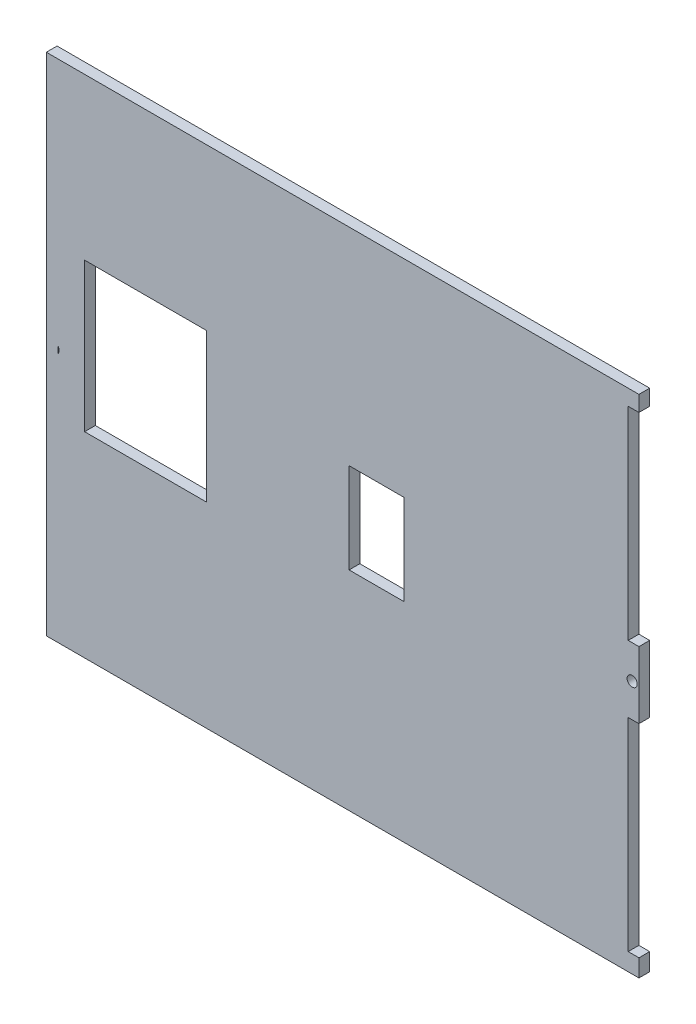
ISO-10303-21;
HEADER;
FILE_DESCRIPTION(('STEP AP214'),'2;1');
FILE_NAME('part.step','',(''),(''),'','','');
FILE_SCHEMA(('AUTOMOTIVE_DESIGN { 1 0 10303 214 1 1 1 1 }'));
ENDSEC;
DATA;
#1=APPLICATION_CONTEXT('core data for automotive mechanical design processes');
#2=APPLICATION_PROTOCOL_DEFINITION('international standard','automotive_design',2000,#1);
#3=PRODUCT_CONTEXT('',#1,'mechanical');
#4=PRODUCT('Part','Part','',(#3));
#5=PRODUCT_RELATED_PRODUCT_CATEGORY('part','',(#4));
#6=PRODUCT_DEFINITION_FORMATION('','',#4);
#7=PRODUCT_DEFINITION_CONTEXT('part definition',#1,'design');
#8=PRODUCT_DEFINITION('design','',#6,#7);
#9=PRODUCT_DEFINITION_SHAPE('','',#8);
#10=(LENGTH_UNIT() NAMED_UNIT(*) SI_UNIT(.MILLI.,.METRE.));
#11=(NAMED_UNIT(*) PLANE_ANGLE_UNIT() SI_UNIT($,.RADIAN.));
#12=(NAMED_UNIT(*) SI_UNIT($,.STERADIAN.) SOLID_ANGLE_UNIT());
#13=UNCERTAINTY_MEASURE_WITH_UNIT(LENGTH_MEASURE(1.E-05),#10,'distance_accuracy_value','');
#14=(GEOMETRIC_REPRESENTATION_CONTEXT(3) GLOBAL_UNCERTAINTY_ASSIGNED_CONTEXT((#13)) GLOBAL_UNIT_ASSIGNED_CONTEXT((#10,
#11,#12)) REPRESENTATION_CONTEXT('',''));
#15=CARTESIAN_POINT('',(0.,0.,0.));
#16=DIRECTION('',(0.,0.,1.));
#17=DIRECTION('',(1.,0.,0.));
#18=AXIS2_PLACEMENT_3D('',#15,#16,#17);
#19=CARTESIAN_POINT('',(87.5,69.85,3.18));
#20=DIRECTION('',(-1.,0.,0.));
#21=DIRECTION('',(0.,-1.,0.));
#22=AXIS2_PLACEMENT_3D('',#19,#20,#21);
#23=PLANE('',#22);
#24=DIRECTION('',(0.,1.,0.));
#25=VECTOR('',#24,1.);
#26=CARTESIAN_POINT('',(87.5,69.85,0.));
#27=LINE('',#26,#25);
#28=CARTESIAN_POINT('',(87.5,-9.875,0.));
#29=VERTEX_POINT('',#28);
#30=CARTESIAN_POINT('',(87.5,9.875,0.));
#31=VERTEX_POINT('',#30);
#32=EDGE_CURVE('E359',#29,#31,#27,.T.);
#33=ORIENTED_EDGE('',*,*,#32,.T.);
#34=DIRECTION('',(0.,0.,1.));
#35=VECTOR('',#34,1.);
#36=CARTESIAN_POINT('',(87.5,9.875,0.));
#37=LINE('',#36,#35);
#38=CARTESIAN_POINT('',(87.5,9.875,3.18));
#39=VERTEX_POINT('',#38);
#40=EDGE_CURVE('E325',#31,#39,#37,.T.);
#41=ORIENTED_EDGE('',*,*,#40,.T.);
#42=DIRECTION('',(0.,1.,0.));
#43=VECTOR('',#42,1.);
#44=CARTESIAN_POINT('',(87.5,69.85,3.18));
#45=LINE('',#44,#43);
#46=CARTESIAN_POINT('',(87.5,-9.875,3.18));
#47=VERTEX_POINT('',#46);
#48=EDGE_CURVE('E362',#47,#39,#45,.T.);
#49=ORIENTED_EDGE('',*,*,#48,.F.);
#50=DIRECTION('',(0.,0.,1.));
#51=VECTOR('',#50,1.);
#52=CARTESIAN_POINT('',(87.5,-9.875,0.));
#53=LINE('',#52,#51);
#54=EDGE_CURVE('E340',#29,#47,#53,.T.);
#55=ORIENTED_EDGE('',*,*,#54,.F.);
#56=EDGE_LOOP('',(#33,#41,#49,#55));
#57=FACE_BOUND('',#56,.T.);
#58=ADVANCED_FACE('F35',(#57),#23,.F.);
#59=CARTESIAN_POINT('',(0.,0.,3.18));
#60=DIRECTION('',(0.,0.,1.));
#61=DIRECTION('',(1.,0.,0.));
#62=AXIS2_PLACEMENT_3D('',#59,#60,#61);
#63=PLANE('',#62);
#64=DIRECTION('',(1.,0.,0.));
#65=VECTOR('',#64,1.);
#66=CARTESIAN_POINT('',(87.5,-69.85,3.18));
#67=LINE('',#66,#65);
#68=CARTESIAN_POINT('',(84.32,-69.85,3.18));
#69=VERTEX_POINT('',#68);
#70=CARTESIAN_POINT('',(87.5,-69.85,3.18));
#71=VERTEX_POINT('',#70);
#72=EDGE_CURVE('E195',#69,#71,#67,.T.);
#73=ORIENTED_EDGE('',*,*,#72,.F.);
#74=DIRECTION('',(0.,-1.,0.));
#75=VECTOR('',#74,1.);
#76=CARTESIAN_POINT('',(84.32,-69.85,3.18));
#77=LINE('',#76,#75);
#78=CARTESIAN_POINT('',(84.32,-9.875,3.18));
#79=VERTEX_POINT('',#78);
#80=EDGE_CURVE('E337',#79,#69,#77,.T.);
#81=ORIENTED_EDGE('',*,*,#80,.F.);
#82=DIRECTION('',(-1.,0.,0.));
#83=VECTOR('',#82,1.);
#84=CARTESIAN_POINT('',(87.5,-9.875,3.18));
#85=LINE('',#84,#83);
#86=EDGE_CURVE('E341',#47,#79,#85,.T.);
#87=ORIENTED_EDGE('',*,*,#86,.F.);
#88=ORIENTED_EDGE('',*,*,#48,.T.);
#89=DIRECTION('',(1.,0.,0.));
#90=VECTOR('',#89,1.);
#91=CARTESIAN_POINT('',(87.5,9.875,3.18));
#92=LINE('',#91,#90);
#93=CARTESIAN_POINT('',(84.32,9.875,3.18));
#94=VERTEX_POINT('',#93);
#95=EDGE_CURVE('E318',#94,#39,#92,.T.);
#96=ORIENTED_EDGE('',*,*,#95,.F.);
#97=DIRECTION('',(0.,-1.,0.));
#98=VECTOR('',#97,1.);
#99=CARTESIAN_POINT('',(84.32,69.85,3.18));
#100=LINE('',#99,#98);
#101=CARTESIAN_POINT('',(84.32,69.85,3.18));
#102=VERTEX_POINT('',#101);
#103=EDGE_CURVE('E307',#102,#94,#100,.T.);
#104=ORIENTED_EDGE('',*,*,#103,.F.);
#105=DIRECTION('',(-1.,0.,0.));
#106=VECTOR('',#105,1.);
#107=CARTESIAN_POINT('',(-84.32,69.85,3.18));
#108=LINE('',#107,#106);
#109=CARTESIAN_POINT('',(87.5,69.85,3.18));
#110=VERTEX_POINT('',#109);
#111=EDGE_CURVE('E221',#110,#102,#108,.T.);
#112=ORIENTED_EDGE('',*,*,#111,.F.);
#113=DIRECTION('',(0.,-1.,0.));
#114=VECTOR('',#113,1.);
#115=CARTESIAN_POINT('',(87.5,69.85,3.18));
#116=LINE('',#115,#114);
#117=CARTESIAN_POINT('',(87.5,74.493800825806,3.18));
#118=VERTEX_POINT('',#117);
#119=EDGE_CURVE('E218',#118,#110,#116,.T.);
#120=ORIENTED_EDGE('',*,*,#119,.F.);
#121=DIRECTION('',(1.,0.,0.));
#122=VECTOR('',#121,1.);
#123=CARTESIAN_POINT('',(-84.32,74.493800825806,3.18));
#124=LINE('',#123,#122);
#125=CARTESIAN_POINT('',(-87.8082205647388,74.493800825806,3.18));
#126=VERTEX_POINT('',#125);
#127=EDGE_CURVE('E216',#126,#118,#124,.T.);
#128=ORIENTED_EDGE('',*,*,#127,.F.);
#129=DIRECTION('',(0.,1.,0.));
#130=VECTOR('',#129,1.);
#131=CARTESIAN_POINT('',(-87.8082205647388,-75.0250038114615,3.18));
#132=LINE('',#131,#130);
#133=CARTESIAN_POINT('',(-87.8082205647388,-75.0250038114615,3.18));
#134=VERTEX_POINT('',#133);
#135=EDGE_CURVE('E205',#134,#126,#132,.T.);
#136=ORIENTED_EDGE('',*,*,#135,.F.);
#137=DIRECTION('',(-1.,0.,0.));
#138=VECTOR('',#137,1.);
#139=CARTESIAN_POINT('',(87.5,-75.0250038114615,3.18));
#140=LINE('',#139,#138);
#141=CARTESIAN_POINT('',(87.5,-75.0250038114615,3.18));
#142=VERTEX_POINT('',#141);
#143=EDGE_CURVE('E186',#142,#134,#140,.T.);
#144=ORIENTED_EDGE('',*,*,#143,.F.);
#145=DIRECTION('',(0.,-1.,0.));
#146=VECTOR('',#145,1.);
#147=CARTESIAN_POINT('',(87.5,-69.85,3.18));
#148=LINE('',#147,#146);
#149=EDGE_CURVE('E203',#71,#142,#148,.T.);
#150=ORIENTED_EDGE('',*,*,#149,.F.);
#151=EDGE_LOOP('',(#73,#81,#87,#88,#96,#104,#112,#120,#128,#136,#144,#150));
#152=FACE_BOUND('',#151,.T.);
#153=CARTESIAN_POINT('',(-85.5,0.,3.18));
#154=DIRECTION('',(0.,0.,1.));
#155=DIRECTION('',(1.,0.,0.));
#156=AXIS2_PLACEMENT_3D('',#153,#154,#155);
#157=CIRCLE('',#156,1.5);
#158=CARTESIAN_POINT('',(-84.32,-0.926066952223204,3.18));
#159=VERTEX_POINT('',#158);
#160=CARTESIAN_POINT('',(-84.32,0.926066952223205,3.18));
#161=VERTEX_POINT('',#160);
#162=EDGE_CURVE('E349',#159,#161,#157,.T.);
#163=ORIENTED_EDGE('',*,*,#162,.F.);
#164=DIRECTION('',(0.,-1.,0.));
#165=VECTOR('',#164,1.);
#166=CARTESIAN_POINT('',(-84.32,-69.85,3.18));
#167=LINE('',#166,#165);
#168=EDGE_CURVE('E223',#161,#159,#167,.T.);
#169=ORIENTED_EDGE('',*,*,#168,.F.);
#170=EDGE_LOOP('',(#163,#169));
#171=FACE_BOUND('',#170,.T.);
#172=DIRECTION('',(0.,1.,0.));
#173=VECTOR('',#172,1.);
#174=CARTESIAN_POINT('',(1.76180209950871,-13.3525709520135,3.18));
#175=LINE('',#174,#173);
#176=CARTESIAN_POINT('',(1.76180209950871,-13.3525709520135,3.18));
#177=VERTEX_POINT('',#176);
#178=CARTESIAN_POINT('',(1.76180209950871,13.3525709520135,3.18));
#179=VERTEX_POINT('',#178);
#180=EDGE_CURVE('E252',#177,#179,#175,.T.);
#181=ORIENTED_EDGE('',*,*,#180,.T.);
#182=DIRECTION('',(1.,0.,0.));
#183=VECTOR('',#182,1.);
#184=CARTESIAN_POINT('',(17.9358844809485,13.3525709520135,3.18));
#185=LINE('',#184,#183);
#186=CARTESIAN_POINT('',(17.9358844809485,13.3525709520135,3.18));
#187=VERTEX_POINT('',#186);
#188=EDGE_CURVE('E255',#179,#187,#185,.T.);
#189=ORIENTED_EDGE('',*,*,#188,.T.);
#190=DIRECTION('',(0.,-1.,0.));
#191=VECTOR('',#190,1.);
#192=CARTESIAN_POINT('',(17.9358844809485,-13.3525709520135,3.18));
#193=LINE('',#192,#191);
#194=CARTESIAN_POINT('',(17.9358844809485,-13.3525709520135,3.18));
#195=VERTEX_POINT('',#194);
#196=EDGE_CURVE('E56',#187,#195,#193,.T.);
#197=ORIENTED_EDGE('',*,*,#196,.T.);
#198=DIRECTION('',(-1.,0.,0.));
#199=VECTOR('',#198,1.);
#200=CARTESIAN_POINT('',(17.9358844809485,-13.3525709520135,3.18));
#201=LINE('',#200,#199);
#202=EDGE_CURVE('E260',#195,#177,#201,.T.);
#203=ORIENTED_EDGE('',*,*,#202,.T.);
#204=EDGE_LOOP('',(#181,#189,#197,#203));
#205=FACE_BOUND('',#204,.T.);
#206=DIRECTION('',(0.,1.,0.));
#207=VECTOR('',#206,1.);
#208=CARTESIAN_POINT('',(-76.4830707518911,-17.0655632801981,3.18));
#209=LINE('',#208,#207);
#210=CARTESIAN_POINT('',(-76.4830707518911,-17.0655632801981,3.18));
#211=VERTEX_POINT('',#210);
#212=CARTESIAN_POINT('',(-76.4830707518911,26.8946423522323,3.18));
#213=VERTEX_POINT('',#212);
#214=EDGE_CURVE('E282',#211,#213,#209,.T.);
#215=ORIENTED_EDGE('',*,*,#214,.T.);
#216=DIRECTION('',(1.,0.,0.));
#217=VECTOR('',#216,1.);
#218=CARTESIAN_POINT('',(-40.4709664732792,26.8946423522323,3.18));
#219=LINE('',#218,#217);
#220=CARTESIAN_POINT('',(-40.4709664732792,26.8946423522323,3.18));
#221=VERTEX_POINT('',#220);
#222=EDGE_CURVE('E285',#213,#221,#219,.T.);
#223=ORIENTED_EDGE('',*,*,#222,.T.);
#224=DIRECTION('',(0.,-1.,0.));
#225=VECTOR('',#224,1.);
#226=CARTESIAN_POINT('',(-40.4709664732792,-17.0655632801981,3.18));
#227=LINE('',#226,#225);
#228=CARTESIAN_POINT('',(-40.4709664732792,-17.0655632801981,3.18));
#229=VERTEX_POINT('',#228);
#230=EDGE_CURVE('E289',#221,#229,#227,.T.);
#231=ORIENTED_EDGE('',*,*,#230,.T.);
#232=DIRECTION('',(-1.,0.,0.));
#233=VECTOR('',#232,1.);
#234=CARTESIAN_POINT('',(-40.4709664732792,-17.0655632801981,3.18));
#235=LINE('',#234,#233);
#236=EDGE_CURVE('E292',#229,#211,#235,.T.);
#237=ORIENTED_EDGE('',*,*,#236,.T.);
#238=EDGE_LOOP('',(#215,#223,#231,#237));
#239=FACE_BOUND('',#238,.T.);
#240=CARTESIAN_POINT('',(85.5,0.,3.18));
#241=DIRECTION('',(0.,0.,1.));
#242=DIRECTION('',(-1.,0.,0.));
#243=AXIS2_PLACEMENT_3D('',#240,#241,#242);
#244=CIRCLE('',#243,1.5);
#245=CARTESIAN_POINT('',(84.,0.,3.18));
#246=VERTEX_POINT('',#245);
#247=EDGE_CURVE('E328',#246,#246,#244,.T.);
#248=ORIENTED_EDGE('',*,*,#247,.F.);
#249=EDGE_LOOP('',(#248));
#250=FACE_BOUND('',#249,.T.);
#251=ADVANCED_FACE('F201',(#152,#171,#205,#239,#250),#63,.T.);
#252=CARTESIAN_POINT('',(0.,0.,0.));
#253=DIRECTION('',(0.,0.,1.));
#254=DIRECTION('',(1.,0.,0.));
#255=AXIS2_PLACEMENT_3D('',#252,#253,#254);
#256=PLANE('',#255);
#257=DIRECTION('',(0.,-1.,0.));
#258=VECTOR('',#257,1.);
#259=CARTESIAN_POINT('',(84.32,-69.85,0.));
#260=LINE('',#259,#258);
#261=CARTESIAN_POINT('',(84.32,-9.875,0.));
#262=VERTEX_POINT('',#261);
#263=CARTESIAN_POINT('',(84.32,-69.85,0.));
#264=VERTEX_POINT('',#263);
#265=EDGE_CURVE('E336',#262,#264,#260,.T.);
#266=ORIENTED_EDGE('',*,*,#265,.T.);
#267=DIRECTION('',(1.,0.,0.));
#268=VECTOR('',#267,1.);
#269=CARTESIAN_POINT('',(87.5,-69.85,0.));
#270=LINE('',#269,#268);
#271=CARTESIAN_POINT('',(87.5,-69.85,0.));
#272=VERTEX_POINT('',#271);
#273=EDGE_CURVE('E211',#264,#272,#270,.T.);
#274=ORIENTED_EDGE('',*,*,#273,.T.);
#275=DIRECTION('',(0.,-1.,0.));
#276=VECTOR('',#275,1.);
#277=CARTESIAN_POINT('',(87.5,-69.85,0.));
#278=LINE('',#277,#276);
#279=CARTESIAN_POINT('',(87.5,-75.0250038114615,0.));
#280=VERTEX_POINT('',#279);
#281=EDGE_CURVE('E226',#272,#280,#278,.T.);
#282=ORIENTED_EDGE('',*,*,#281,.T.);
#283=DIRECTION('',(-1.,0.,0.));
#284=VECTOR('',#283,1.);
#285=CARTESIAN_POINT('',(-84.32,-75.0250038114615,0.));
#286=LINE('',#285,#284);
#287=CARTESIAN_POINT('',(-87.8082205647388,-75.0250038114615,0.));
#288=VERTEX_POINT('',#287);
#289=EDGE_CURVE('E189',#280,#288,#286,.T.);
#290=ORIENTED_EDGE('',*,*,#289,.T.);
#291=DIRECTION('',(0.,1.,0.));
#292=VECTOR('',#291,1.);
#293=CARTESIAN_POINT('',(-87.8082205647388,-69.85,0.));
#294=LINE('',#293,#292);
#295=CARTESIAN_POINT('',(-87.8082205647388,74.493800825806,0.));
#296=VERTEX_POINT('',#295);
#297=EDGE_CURVE('E229',#288,#296,#294,.T.);
#298=ORIENTED_EDGE('',*,*,#297,.T.);
#299=DIRECTION('',(1.,0.,0.));
#300=VECTOR('',#299,1.);
#301=CARTESIAN_POINT('',(-84.32,74.493800825806,0.));
#302=LINE('',#301,#300);
#303=CARTESIAN_POINT('',(87.5,74.493800825806,0.));
#304=VERTEX_POINT('',#303);
#305=EDGE_CURVE('E232',#296,#304,#302,.T.);
#306=ORIENTED_EDGE('',*,*,#305,.T.);
#307=DIRECTION('',(0.,-1.,0.));
#308=VECTOR('',#307,1.);
#309=CARTESIAN_POINT('',(87.5,69.85,0.));
#310=LINE('',#309,#308);
#311=CARTESIAN_POINT('',(87.5,69.85,0.));
#312=VERTEX_POINT('',#311);
#313=EDGE_CURVE('E235',#304,#312,#310,.T.);
#314=ORIENTED_EDGE('',*,*,#313,.T.);
#315=DIRECTION('',(-1.,0.,0.));
#316=VECTOR('',#315,1.);
#317=CARTESIAN_POINT('',(-84.32,69.85,0.));
#318=LINE('',#317,#316);
#319=CARTESIAN_POINT('',(84.32,69.85,0.));
#320=VERTEX_POINT('',#319);
#321=EDGE_CURVE('E238',#312,#320,#318,.T.);
#322=ORIENTED_EDGE('',*,*,#321,.T.);
#323=DIRECTION('',(0.,-1.,0.));
#324=VECTOR('',#323,1.);
#325=CARTESIAN_POINT('',(84.32,69.85,0.));
#326=LINE('',#325,#324);
#327=CARTESIAN_POINT('',(84.32,9.875,0.));
#328=VERTEX_POINT('',#327);
#329=EDGE_CURVE('E314',#320,#328,#326,.T.);
#330=ORIENTED_EDGE('',*,*,#329,.T.);
#331=DIRECTION('',(1.,0.,0.));
#332=VECTOR('',#331,1.);
#333=CARTESIAN_POINT('',(87.5,9.875,0.));
#334=LINE('',#333,#332);
#335=EDGE_CURVE('E317',#328,#31,#334,.T.);
#336=ORIENTED_EDGE('',*,*,#335,.T.);
#337=ORIENTED_EDGE('',*,*,#32,.F.);
#338=DIRECTION('',(-1.,0.,0.));
#339=VECTOR('',#338,1.);
#340=CARTESIAN_POINT('',(87.5,-9.875,0.));
#341=LINE('',#340,#339);
#342=EDGE_CURVE('E333',#29,#262,#341,.T.);
#343=ORIENTED_EDGE('',*,*,#342,.T.);
#344=EDGE_LOOP('',(#266,#274,#282,#290,#298,#306,#314,#322,#330,#336,#337,#343));
#345=FACE_BOUND('',#344,.T.);
#346=DIRECTION('',(0.,-1.,0.));
#347=VECTOR('',#346,1.);
#348=CARTESIAN_POINT('',(-84.32,-69.85,0.));
#349=LINE('',#348,#347);
#350=CARTESIAN_POINT('',(-84.32,0.926066952223205,0.));
#351=VERTEX_POINT('',#350);
#352=CARTESIAN_POINT('',(-84.32,-0.926066952223199,0.));
#353=VERTEX_POINT('',#352);
#354=EDGE_CURVE('E48',#351,#353,#349,.T.);
#355=ORIENTED_EDGE('',*,*,#354,.T.);
#356=CARTESIAN_POINT('',(-85.5,0.,0.));
#357=DIRECTION('',(0.,0.,1.));
#358=DIRECTION('',(1.,0.,0.));
#359=AXIS2_PLACEMENT_3D('',#356,#357,#358);
#360=CIRCLE('',#359,1.5);
#361=EDGE_CURVE('E357',#353,#351,#360,.T.);
#362=ORIENTED_EDGE('',*,*,#361,.T.);
#363=EDGE_LOOP('',(#355,#362));
#364=FACE_BOUND('',#363,.T.);
#365=DIRECTION('',(1.,0.,0.));
#366=VECTOR('',#365,1.);
#367=CARTESIAN_POINT('',(17.9358844809485,13.3525709520135,0.));
#368=LINE('',#367,#366);
#369=CARTESIAN_POINT('',(1.76180209950871,13.3525709520135,0.));
#370=VERTEX_POINT('',#369);
#371=CARTESIAN_POINT('',(17.9358844809485,13.3525709520135,0.));
#372=VERTEX_POINT('',#371);
#373=EDGE_CURVE('E265',#370,#372,#368,.T.);
#374=ORIENTED_EDGE('',*,*,#373,.F.);
#375=DIRECTION('',(0.,1.,0.));
#376=VECTOR('',#375,1.);
#377=CARTESIAN_POINT('',(1.76180209950871,-13.3525709520135,0.));
#378=LINE('',#377,#376);
#379=CARTESIAN_POINT('',(1.76180209950871,-13.3525709520135,0.));
#380=VERTEX_POINT('',#379);
#381=EDGE_CURVE('E243',#380,#370,#378,.T.);
#382=ORIENTED_EDGE('',*,*,#381,.F.);
#383=DIRECTION('',(-1.,0.,0.));
#384=VECTOR('',#383,1.);
#385=CARTESIAN_POINT('',(17.9358844809485,-13.3525709520135,0.));
#386=LINE('',#385,#384);
#387=CARTESIAN_POINT('',(17.9358844809485,-13.3525709520135,0.));
#388=VERTEX_POINT('',#387);
#389=EDGE_CURVE('E256',#388,#380,#386,.T.);
#390=ORIENTED_EDGE('',*,*,#389,.F.);
#391=DIRECTION('',(0.,-1.,0.));
#392=VECTOR('',#391,1.);
#393=CARTESIAN_POINT('',(17.9358844809485,-13.3525709520135,0.));
#394=LINE('',#393,#392);
#395=EDGE_CURVE('E268',#372,#388,#394,.T.);
#396=ORIENTED_EDGE('',*,*,#395,.F.);
#397=EDGE_LOOP('',(#374,#382,#390,#396));
#398=FACE_BOUND('',#397,.T.);
#399=DIRECTION('',(1.,0.,0.));
#400=VECTOR('',#399,1.);
#401=CARTESIAN_POINT('',(-40.4709664732792,26.8946423522323,0.));
#402=LINE('',#401,#400);
#403=CARTESIAN_POINT('',(-76.4830707518911,26.8946423522323,0.));
#404=VERTEX_POINT('',#403);
#405=CARTESIAN_POINT('',(-40.4709664732792,26.8946423522323,0.));
#406=VERTEX_POINT('',#405);
#407=EDGE_CURVE('E297',#404,#406,#402,.T.);
#408=ORIENTED_EDGE('',*,*,#407,.F.);
#409=DIRECTION('',(0.,1.,0.));
#410=VECTOR('',#409,1.);
#411=CARTESIAN_POINT('',(-76.4830707518911,-17.0655632801981,0.));
#412=LINE('',#411,#410);
#413=CARTESIAN_POINT('',(-76.4830707518911,-17.0655632801981,0.));
#414=VERTEX_POINT('',#413);
#415=EDGE_CURVE('E275',#414,#404,#412,.T.);
#416=ORIENTED_EDGE('',*,*,#415,.F.);
#417=DIRECTION('',(-1.,0.,0.));
#418=VECTOR('',#417,1.);
#419=CARTESIAN_POINT('',(-40.4709664732792,-17.0655632801981,0.));
#420=LINE('',#419,#418);
#421=CARTESIAN_POINT('',(-40.4709664732792,-17.0655632801981,0.));
#422=VERTEX_POINT('',#421);
#423=EDGE_CURVE('E286',#422,#414,#420,.T.);
#424=ORIENTED_EDGE('',*,*,#423,.F.);
#425=DIRECTION('',(0.,-1.,0.));
#426=VECTOR('',#425,1.);
#427=CARTESIAN_POINT('',(-40.4709664732792,-17.0655632801981,0.));
#428=LINE('',#427,#426);
#429=EDGE_CURVE('E300',#406,#422,#428,.T.);
#430=ORIENTED_EDGE('',*,*,#429,.F.);
#431=EDGE_LOOP('',(#408,#416,#424,#430));
#432=FACE_BOUND('',#431,.T.);
#433=CARTESIAN_POINT('',(85.5,0.,0.));
#434=DIRECTION('',(0.,0.,1.));
#435=DIRECTION('',(-1.,0.,0.));
#436=AXIS2_PLACEMENT_3D('',#433,#434,#435);
#437=CIRCLE('',#436,1.5);
#438=CARTESIAN_POINT('',(84.,0.,0.));
#439=VERTEX_POINT('',#438);
#440=EDGE_CURVE('E344',#439,#439,#437,.T.);
#441=ORIENTED_EDGE('',*,*,#440,.T.);
#442=EDGE_LOOP('',(#441));
#443=FACE_BOUND('',#442,.T.);
#444=ADVANCED_FACE('F375',(#345,#364,#398,#432,#443),#256,.F.);
#445=CARTESIAN_POINT('',(84.32,-69.85,0.));
#446=DIRECTION('',(-1.,0.,0.));
#447=DIRECTION('',(0.,0.,1.));
#448=AXIS2_PLACEMENT_3D('',#445,#446,#447);
#449=PLANE('',#448);
#450=ORIENTED_EDGE('',*,*,#80,.T.);
#451=DIRECTION('',(0.,0.,1.));
#452=VECTOR('',#451,1.);
#453=CARTESIAN_POINT('',(84.32,-69.85,0.));
#454=LINE('',#453,#452);
#455=EDGE_CURVE('E347',#264,#69,#454,.T.);
#456=ORIENTED_EDGE('',*,*,#455,.F.);
#457=ORIENTED_EDGE('',*,*,#265,.F.);
#458=DIRECTION('',(0.,0.,1.));
#459=VECTOR('',#458,1.);
#460=CARTESIAN_POINT('',(84.32,-9.875,0.));
#461=LINE('',#460,#459);
#462=EDGE_CURVE('E350',#262,#79,#461,.T.);
#463=ORIENTED_EDGE('',*,*,#462,.T.);
#464=EDGE_LOOP('',(#450,#456,#457,#463));
#465=FACE_BOUND('',#464,.T.);
#466=ADVANCED_FACE('F378',(#465),#449,.F.);
#467=CARTESIAN_POINT('',(87.5,-9.875,0.));
#468=DIRECTION('',(0.,1.,0.));
#469=DIRECTION('',(-1.,0.,0.));
#470=AXIS2_PLACEMENT_3D('',#467,#468,#469);
#471=PLANE('',#470);
#472=ORIENTED_EDGE('',*,*,#86,.T.);
#473=ORIENTED_EDGE('',*,*,#462,.F.);
#474=ORIENTED_EDGE('',*,*,#342,.F.);
#475=ORIENTED_EDGE('',*,*,#54,.T.);
#476=EDGE_LOOP('',(#472,#473,#474,#475));
#477=FACE_BOUND('',#476,.T.);
#478=ADVANCED_FACE('F394',(#477),#471,.F.);
#479=CARTESIAN_POINT('',(85.5,0.,0.));
#480=DIRECTION('',(0.,0.,1.));
#481=DIRECTION('',(1.,0.,0.));
#482=AXIS2_PLACEMENT_3D('',#479,#480,#481);
#483=CYLINDRICAL_SURFACE('',#482,1.5);
#484=ORIENTED_EDGE('',*,*,#440,.F.);
#485=EDGE_LOOP('',(#484));
#486=FACE_BOUND('',#485,.T.);
#487=ORIENTED_EDGE('',*,*,#247,.T.);
#488=EDGE_LOOP('',(#487));
#489=FACE_BOUND('',#488,.T.);
#490=ADVANCED_FACE('F390',(#486,#489),#483,.F.);
#491=CARTESIAN_POINT('',(87.5,9.875,0.));
#492=DIRECTION('',(0.,-1.,0.));
#493=DIRECTION('',(1.,0.,0.));
#494=AXIS2_PLACEMENT_3D('',#491,#492,#493);
#495=PLANE('',#494);
#496=ORIENTED_EDGE('',*,*,#95,.T.);
#497=ORIENTED_EDGE('',*,*,#40,.F.);
#498=ORIENTED_EDGE('',*,*,#335,.F.);
#499=DIRECTION('',(0.,0.,1.));
#500=VECTOR('',#499,1.);
#501=CARTESIAN_POINT('',(84.32,9.875,0.));
#502=LINE('',#501,#500);
#503=EDGE_CURVE('E329',#328,#94,#502,.T.);
#504=ORIENTED_EDGE('',*,*,#503,.T.);
#505=EDGE_LOOP('',(#496,#497,#498,#504));
#506=FACE_BOUND('',#505,.T.);
#507=ADVANCED_FACE('F393',(#506),#495,.F.);
#508=CARTESIAN_POINT('',(84.32,69.85,0.));
#509=DIRECTION('',(-1.,0.,0.));
#510=DIRECTION('',(0.,-1.,0.));
#511=AXIS2_PLACEMENT_3D('',#508,#509,#510);
#512=PLANE('',#511);
#513=ORIENTED_EDGE('',*,*,#103,.T.);
#514=ORIENTED_EDGE('',*,*,#503,.F.);
#515=ORIENTED_EDGE('',*,*,#329,.F.);
#516=DIRECTION('',(0.,0.,1.));
#517=VECTOR('',#516,1.);
#518=CARTESIAN_POINT('',(84.32,69.85,0.));
#519=LINE('',#518,#517);
#520=EDGE_CURVE('E321',#320,#102,#519,.T.);
#521=ORIENTED_EDGE('',*,*,#520,.T.);
#522=EDGE_LOOP('',(#513,#514,#515,#521));
#523=FACE_BOUND('',#522,.T.);
#524=ADVANCED_FACE('F407',(#523),#512,.F.);
#525=CARTESIAN_POINT('',(-85.5,0.,0.));
#526=DIRECTION('',(0.,0.,1.));
#527=DIRECTION('',(1.,0.,0.));
#528=AXIS2_PLACEMENT_3D('',#525,#526,#527);
#529=CYLINDRICAL_SURFACE('',#528,1.5);
#530=ORIENTED_EDGE('',*,*,#162,.T.);
#531=DIRECTION('',(0.,0.,1.));
#532=VECTOR('',#531,1.);
#533=CARTESIAN_POINT('',(-84.32,0.926066952223213,0.));
#534=LINE('',#533,#532);
#535=EDGE_CURVE('E11',#161,#351,#534,.F.);
#536=ORIENTED_EDGE('',*,*,#535,.T.);
#537=ORIENTED_EDGE('',*,*,#361,.F.);
#538=DIRECTION('',(0.,0.,1.));
#539=VECTOR('',#538,1.);
#540=CARTESIAN_POINT('',(-84.32,-0.926066952223213,0.));
#541=LINE('',#540,#539);
#542=EDGE_CURVE('E42',#353,#159,#541,.T.);
#543=ORIENTED_EDGE('',*,*,#542,.T.);
#544=EDGE_LOOP('',(#530,#536,#537,#543));
#545=FACE_BOUND('',#544,.T.);
#546=ADVANCED_FACE('F370',(#545),#529,.F.);
#547=CARTESIAN_POINT('',(-76.4830707518911,-17.0655632801981,3.18));
#548=DIRECTION('',(-1.,0.,0.));
#549=DIRECTION('',(0.,0.,1.));
#550=AXIS2_PLACEMENT_3D('',#547,#548,#549);
#551=PLANE('',#550);
#552=ORIENTED_EDGE('',*,*,#415,.T.);
#553=DIRECTION('',(0.,0.,-1.));
#554=VECTOR('',#553,1.);
#555=CARTESIAN_POINT('',(-76.4830707518911,26.8946423522323,3.18));
#556=LINE('',#555,#554);
#557=EDGE_CURVE('E295',#213,#404,#556,.T.);
#558=ORIENTED_EDGE('',*,*,#557,.F.);
#559=ORIENTED_EDGE('',*,*,#214,.F.);
#560=DIRECTION('',(0.,0.,-1.));
#561=VECTOR('',#560,1.);
#562=CARTESIAN_POINT('',(-76.4830707518911,-17.0655632801981,3.18));
#563=LINE('',#562,#561);
#564=EDGE_CURVE('E305',#211,#414,#563,.T.);
#565=ORIENTED_EDGE('',*,*,#564,.T.);
#566=EDGE_LOOP('',(#552,#558,#559,#565));
#567=FACE_BOUND('',#566,.T.);
#568=ADVANCED_FACE('F406',(#567),#551,.F.);
#569=CARTESIAN_POINT('',(-40.4709664732792,-17.0655632801981,3.18));
#570=DIRECTION('',(0.,-1.,0.));
#571=DIRECTION('',(0.,0.,-1.));
#572=AXIS2_PLACEMENT_3D('',#569,#570,#571);
#573=PLANE('',#572);
#574=ORIENTED_EDGE('',*,*,#423,.T.);
#575=ORIENTED_EDGE('',*,*,#564,.F.);
#576=ORIENTED_EDGE('',*,*,#236,.F.);
#577=DIRECTION('',(0.,0.,-1.));
#578=VECTOR('',#577,1.);
#579=CARTESIAN_POINT('',(-40.4709664732792,-17.0655632801981,3.18));
#580=LINE('',#579,#578);
#581=EDGE_CURVE('E308',#229,#422,#580,.T.);
#582=ORIENTED_EDGE('',*,*,#581,.T.);
#583=EDGE_LOOP('',(#574,#575,#576,#582));
#584=FACE_BOUND('',#583,.T.);
#585=ADVANCED_FACE('F423',(#584),#573,.F.);
#586=CARTESIAN_POINT('',(-40.4709664732792,-17.0655632801981,3.18));
#587=DIRECTION('',(1.,0.,0.));
#588=DIRECTION('',(0.,0.,-1.));
#589=AXIS2_PLACEMENT_3D('',#586,#587,#588);
#590=PLANE('',#589);
#591=ORIENTED_EDGE('',*,*,#429,.T.);
#592=ORIENTED_EDGE('',*,*,#581,.F.);
#593=ORIENTED_EDGE('',*,*,#230,.F.);
#594=DIRECTION('',(0.,0.,-1.));
#595=VECTOR('',#594,1.);
#596=CARTESIAN_POINT('',(-40.4709664732792,26.8946423522323,3.18));
#597=LINE('',#596,#595);
#598=EDGE_CURVE('E310',#221,#406,#597,.T.);
#599=ORIENTED_EDGE('',*,*,#598,.T.);
#600=EDGE_LOOP('',(#591,#592,#593,#599));
#601=FACE_BOUND('',#600,.T.);
#602=ADVANCED_FACE('F429',(#601),#590,.F.);
#603=CARTESIAN_POINT('',(-40.4709664732792,26.8946423522323,3.18));
#604=DIRECTION('',(0.,1.,0.));
#605=DIRECTION('',(0.,0.,1.));
#606=AXIS2_PLACEMENT_3D('',#603,#604,#605);
#607=PLANE('',#606);
#608=ORIENTED_EDGE('',*,*,#407,.T.);
#609=ORIENTED_EDGE('',*,*,#598,.F.);
#610=ORIENTED_EDGE('',*,*,#222,.F.);
#611=ORIENTED_EDGE('',*,*,#557,.T.);
#612=EDGE_LOOP('',(#608,#609,#610,#611));
#613=FACE_BOUND('',#612,.T.);
#614=ADVANCED_FACE('F425',(#613),#607,.F.);
#615=CARTESIAN_POINT('',(1.76180209950871,-13.3525709520135,3.18));
#616=DIRECTION('',(-1.,0.,0.));
#617=DIRECTION('',(0.,0.,1.));
#618=AXIS2_PLACEMENT_3D('',#615,#616,#617);
#619=PLANE('',#618);
#620=ORIENTED_EDGE('',*,*,#381,.T.);
#621=DIRECTION('',(0.,0.,-1.));
#622=VECTOR('',#621,1.);
#623=CARTESIAN_POINT('',(1.76180209950871,13.3525709520135,3.18));
#624=LINE('',#623,#622);
#625=EDGE_CURVE('E263',#179,#370,#624,.T.);
#626=ORIENTED_EDGE('',*,*,#625,.F.);
#627=ORIENTED_EDGE('',*,*,#180,.F.);
#628=DIRECTION('',(0.,0.,-1.));
#629=VECTOR('',#628,1.);
#630=CARTESIAN_POINT('',(1.76180209950871,-13.3525709520135,3.18));
#631=LINE('',#630,#629);
#632=EDGE_CURVE('E273',#177,#380,#631,.T.);
#633=ORIENTED_EDGE('',*,*,#632,.T.);
#634=EDGE_LOOP('',(#620,#626,#627,#633));
#635=FACE_BOUND('',#634,.T.);
#636=ADVANCED_FACE('F428',(#635),#619,.F.);
#637=CARTESIAN_POINT('',(17.9358844809485,-13.3525709520135,3.18));
#638=DIRECTION('',(0.,-1.,0.));
#639=DIRECTION('',(0.,0.,-1.));
#640=AXIS2_PLACEMENT_3D('',#637,#638,#639);
#641=PLANE('',#640);
#642=ORIENTED_EDGE('',*,*,#389,.T.);
#643=ORIENTED_EDGE('',*,*,#632,.F.);
#644=ORIENTED_EDGE('',*,*,#202,.F.);
#645=DIRECTION('',(0.,0.,-1.));
#646=VECTOR('',#645,1.);
#647=CARTESIAN_POINT('',(17.9358844809485,-13.3525709520135,3.18));
#648=LINE('',#647,#646);
#649=EDGE_CURVE('E276',#195,#388,#648,.T.);
#650=ORIENTED_EDGE('',*,*,#649,.T.);
#651=EDGE_LOOP('',(#642,#643,#644,#650));
#652=FACE_BOUND('',#651,.T.);
#653=ADVANCED_FACE('F439',(#652),#641,.F.);
#654=CARTESIAN_POINT('',(17.9358844809485,-13.3525709520135,3.18));
#655=DIRECTION('',(1.,0.,0.));
#656=DIRECTION('',(0.,0.,-1.));
#657=AXIS2_PLACEMENT_3D('',#654,#655,#656);
#658=PLANE('',#657);
#659=ORIENTED_EDGE('',*,*,#395,.T.);
#660=ORIENTED_EDGE('',*,*,#649,.F.);
#661=ORIENTED_EDGE('',*,*,#196,.F.);
#662=DIRECTION('',(0.,0.,-1.));
#663=VECTOR('',#662,1.);
#664=CARTESIAN_POINT('',(17.9358844809485,13.3525709520135,3.18));
#665=LINE('',#664,#663);
#666=EDGE_CURVE('E278',#187,#372,#665,.T.);
#667=ORIENTED_EDGE('',*,*,#666,.T.);
#668=EDGE_LOOP('',(#659,#660,#661,#667));
#669=FACE_BOUND('',#668,.T.);
#670=ADVANCED_FACE('F444',(#669),#658,.F.);
#671=CARTESIAN_POINT('',(17.9358844809485,13.3525709520135,3.18));
#672=DIRECTION('',(0.,1.,0.));
#673=DIRECTION('',(0.,0.,1.));
#674=AXIS2_PLACEMENT_3D('',#671,#672,#673);
#675=PLANE('',#674);
#676=ORIENTED_EDGE('',*,*,#373,.T.);
#677=ORIENTED_EDGE('',*,*,#666,.F.);
#678=ORIENTED_EDGE('',*,*,#188,.F.);
#679=ORIENTED_EDGE('',*,*,#625,.T.);
#680=EDGE_LOOP('',(#676,#677,#678,#679));
#681=FACE_BOUND('',#680,.T.);
#682=ADVANCED_FACE('F441',(#681),#675,.F.);
#683=CARTESIAN_POINT('',(-84.32,-69.85,3.18));
#684=DIRECTION('',(1.,0.,0.));
#685=DIRECTION('',(0.,1.,0.));
#686=AXIS2_PLACEMENT_3D('',#683,#684,#685);
#687=PLANE('',#686);
#688=ORIENTED_EDGE('',*,*,#535,.F.);
#689=ORIENTED_EDGE('',*,*,#168,.T.);
#690=ORIENTED_EDGE('',*,*,#542,.F.);
#691=ORIENTED_EDGE('',*,*,#354,.F.);
#692=EDGE_LOOP('',(#688,#689,#690,#691));
#693=FACE_BOUND('',#692,.T.);
#694=ADVANCED_FACE('F374',(#693),#687,.T.);
#695=CARTESIAN_POINT('',(-84.32,69.85,3.18));
#696=DIRECTION('',(0.,-1.,0.));
#697=DIRECTION('',(0.,0.,-1.));
#698=AXIS2_PLACEMENT_3D('',#695,#696,#697);
#699=PLANE('',#698);
#700=ORIENTED_EDGE('',*,*,#520,.F.);
#701=ORIENTED_EDGE('',*,*,#321,.F.);
#702=DIRECTION('',(0.,0.,-1.));
#703=VECTOR('',#702,1.);
#704=CARTESIAN_POINT('',(87.5,69.85,3.18));
#705=LINE('',#704,#703);
#706=EDGE_CURVE('E244',#110,#312,#705,.T.);
#707=ORIENTED_EDGE('',*,*,#706,.F.);
#708=ORIENTED_EDGE('',*,*,#111,.T.);
#709=EDGE_LOOP('',(#700,#701,#707,#708));
#710=FACE_BOUND('',#709,.T.);
#711=ADVANCED_FACE('F468',(#710),#699,.T.);
#712=CARTESIAN_POINT('',(87.5,-69.85,3.18));
#713=DIRECTION('',(0.,1.,0.));
#714=DIRECTION('',(0.,0.,1.));
#715=AXIS2_PLACEMENT_3D('',#712,#713,#714);
#716=PLANE('',#715);
#717=ORIENTED_EDGE('',*,*,#455,.T.);
#718=ORIENTED_EDGE('',*,*,#72,.T.);
#719=DIRECTION('',(0.,0.,-1.));
#720=VECTOR('',#719,1.);
#721=CARTESIAN_POINT('',(87.5,-69.85,3.18));
#722=LINE('',#721,#720);
#723=EDGE_CURVE('E210',#71,#272,#722,.T.);
#724=ORIENTED_EDGE('',*,*,#723,.T.);
#725=ORIENTED_EDGE('',*,*,#273,.F.);
#726=EDGE_LOOP('',(#717,#718,#724,#725));
#727=FACE_BOUND('',#726,.T.);
#728=ADVANCED_FACE('F454',(#727),#716,.T.);
#729=CARTESIAN_POINT('',(87.5,-69.85,3.18));
#730=DIRECTION('',(1.,0.,0.));
#731=DIRECTION('',(0.,0.,-1.));
#732=AXIS2_PLACEMENT_3D('',#729,#730,#731);
#733=PLANE('',#732);
#734=ORIENTED_EDGE('',*,*,#281,.F.);
#735=ORIENTED_EDGE('',*,*,#723,.F.);
#736=ORIENTED_EDGE('',*,*,#149,.T.);
#737=DIRECTION('',(0.,0.,-1.));
#738=VECTOR('',#737,1.);
#739=CARTESIAN_POINT('',(87.5,-75.0250038114615,3.18));
#740=LINE('',#739,#738);
#741=EDGE_CURVE('E182',#142,#280,#740,.T.);
#742=ORIENTED_EDGE('',*,*,#741,.T.);
#743=EDGE_LOOP('',(#734,#735,#736,#742));
#744=FACE_BOUND('',#743,.T.);
#745=ADVANCED_FACE('F208',(#744),#733,.T.);
#746=CARTESIAN_POINT('',(87.5,69.85,3.18));
#747=DIRECTION('',(1.,0.,0.));
#748=DIRECTION('',(0.,0.,-1.));
#749=AXIS2_PLACEMENT_3D('',#746,#747,#748);
#750=PLANE('',#749);
#751=ORIENTED_EDGE('',*,*,#313,.F.);
#752=DIRECTION('',(0.,0.,-1.));
#753=VECTOR('',#752,1.);
#754=CARTESIAN_POINT('',(87.5,74.493800825806,3.18));
#755=LINE('',#754,#753);
#756=EDGE_CURVE('E246',#118,#304,#755,.T.);
#757=ORIENTED_EDGE('',*,*,#756,.F.);
#758=ORIENTED_EDGE('',*,*,#119,.T.);
#759=ORIENTED_EDGE('',*,*,#706,.T.);
#760=EDGE_LOOP('',(#751,#757,#758,#759));
#761=FACE_BOUND('',#760,.T.);
#762=ADVANCED_FACE('F453',(#761),#750,.T.);
#763=CARTESIAN_POINT('',(-84.32,74.493800825806,3.18));
#764=DIRECTION('',(0.,1.,0.));
#765=DIRECTION('',(0.,0.,1.));
#766=AXIS2_PLACEMENT_3D('',#763,#764,#765);
#767=PLANE('',#766);
#768=ORIENTED_EDGE('',*,*,#305,.F.);
#769=DIRECTION('',(0.,0.,-1.));
#770=VECTOR('',#769,1.);
#771=CARTESIAN_POINT('',(-87.8082205647388,74.493800825806,3.18));
#772=LINE('',#771,#770);
#773=EDGE_CURVE('E248',#126,#296,#772,.T.);
#774=ORIENTED_EDGE('',*,*,#773,.F.);
#775=ORIENTED_EDGE('',*,*,#127,.T.);
#776=ORIENTED_EDGE('',*,*,#756,.T.);
#777=EDGE_LOOP('',(#768,#774,#775,#776));
#778=FACE_BOUND('',#777,.T.);
#779=ADVANCED_FACE('F460',(#778),#767,.T.);
#780=CARTESIAN_POINT('',(-87.8082205647388,-69.85,3.18));
#781=DIRECTION('',(-1.,0.,0.));
#782=DIRECTION('',(0.,0.,1.));
#783=AXIS2_PLACEMENT_3D('',#780,#781,#782);
#784=PLANE('',#783);
#785=ORIENTED_EDGE('',*,*,#297,.F.);
#786=DIRECTION('',(0.,0.,-1.));
#787=VECTOR('',#786,1.);
#788=CARTESIAN_POINT('',(-87.8082205647388,-75.0250038114615,3.18));
#789=LINE('',#788,#787);
#790=EDGE_CURVE('E194',#134,#288,#789,.T.);
#791=ORIENTED_EDGE('',*,*,#790,.F.);
#792=ORIENTED_EDGE('',*,*,#135,.T.);
#793=ORIENTED_EDGE('',*,*,#773,.T.);
#794=EDGE_LOOP('',(#785,#791,#792,#793));
#795=FACE_BOUND('',#794,.T.);
#796=ADVANCED_FACE('F457',(#795),#784,.T.);
#797=CARTESIAN_POINT('',(-84.32,-75.0250038114615,3.18));
#798=DIRECTION('',(0.,-1.,0.));
#799=DIRECTION('',(0.,0.,-1.));
#800=AXIS2_PLACEMENT_3D('',#797,#798,#799);
#801=PLANE('',#800);
#802=ORIENTED_EDGE('',*,*,#289,.F.);
#803=ORIENTED_EDGE('',*,*,#741,.F.);
#804=ORIENTED_EDGE('',*,*,#143,.T.);
#805=ORIENTED_EDGE('',*,*,#790,.T.);
#806=EDGE_LOOP('',(#802,#803,#804,#805));
#807=FACE_BOUND('',#806,.T.);
#808=ADVANCED_FACE('F184',(#807),#801,.T.);
#809=CLOSED_SHELL('',(#58,#251,#444,#466,#478,#490,#507,#524,#546,#568,#585,#602,#614,#636,#653,
#670,#682,#694,#711,#728,#745,#762,#779,#796,#808));
#810=MANIFOLD_SOLID_BREP('B2',#809);
#811=ADVANCED_BREP_SHAPE_REPRESENTATION('',(#18,#810),#14);
#812=SHAPE_DEFINITION_REPRESENTATION(#9,#811);
ENDSEC;
END-ISO-10303-21;
